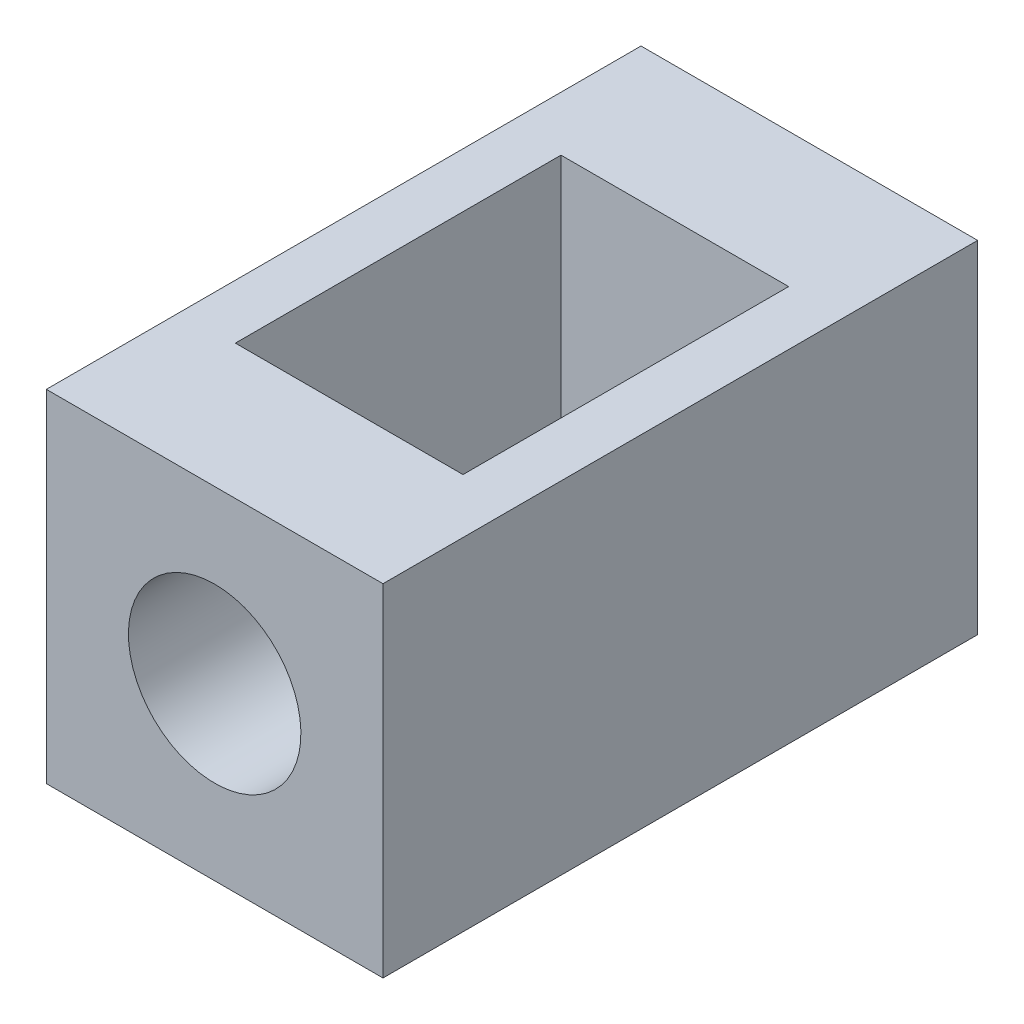
ISO-10303-21;
HEADER;
FILE_DESCRIPTION(('STEP AP214'),'2;1');
FILE_NAME('part.step','',(''),(''),'','','');
FILE_SCHEMA(('AUTOMOTIVE_DESIGN { 1 0 10303 214 1 1 1 1 }'));
ENDSEC;
DATA;
#1=APPLICATION_CONTEXT('core data for automotive mechanical design processes');
#2=APPLICATION_PROTOCOL_DEFINITION('international standard','automotive_design',2000,#1);
#3=PRODUCT_CONTEXT('',#1,'mechanical');
#4=PRODUCT('Part','Part','',(#3));
#5=PRODUCT_RELATED_PRODUCT_CATEGORY('part','',(#4));
#6=PRODUCT_DEFINITION_FORMATION('','',#4);
#7=PRODUCT_DEFINITION_CONTEXT('part definition',#1,'design');
#8=PRODUCT_DEFINITION('design','',#6,#7);
#9=PRODUCT_DEFINITION_SHAPE('','',#8);
#10=(LENGTH_UNIT() NAMED_UNIT(*) SI_UNIT(.MILLI.,.METRE.));
#11=(NAMED_UNIT(*) PLANE_ANGLE_UNIT() SI_UNIT($,.RADIAN.));
#12=(NAMED_UNIT(*) SI_UNIT($,.STERADIAN.) SOLID_ANGLE_UNIT());
#13=UNCERTAINTY_MEASURE_WITH_UNIT(LENGTH_MEASURE(1.E-05),#10,'distance_accuracy_value','');
#14=(GEOMETRIC_REPRESENTATION_CONTEXT(3) GLOBAL_UNCERTAINTY_ASSIGNED_CONTEXT((#13)) GLOBAL_UNIT_ASSIGNED_CONTEXT((#10,
#11,#12)) REPRESENTATION_CONTEXT('',''));
#15=CARTESIAN_POINT('',(0.,0.,0.));
#16=DIRECTION('',(0.,0.,1.));
#17=DIRECTION('',(1.,0.,0.));
#18=AXIS2_PLACEMENT_3D('',#15,#16,#17);
#19=CARTESIAN_POINT('',(-7.60780190320781,-23.3190340135445,14.4950000000002));
#20=DIRECTION('',(0.,0.,1.));
#21=DIRECTION('',(3.01991605000675E-07,0.999999999999954,0.));
#22=AXIS2_PLACEMENT_3D('',#19,#20,#21);
#23=CYLINDRICAL_SURFACE('',#22,1.25);
#24=CARTESIAN_POINT('',(-7.60780190320781,-23.3190340135447,12.5450000000002));
#25=DIRECTION('',(0.,0.,1.));
#26=DIRECTION('',(3.01991605000675E-07,0.999999999999954,0.));
#27=AXIS2_PLACEMENT_3D('',#24,#25,#26);
#28=CIRCLE('',#27,1.25);
#29=CARTESIAN_POINT('',(-7.6078015257183,-22.0690340135448,12.5450000000002));
#30=VERTEX_POINT('',#29);
#31=EDGE_CURVE('E20',#30,#30,#28,.T.);
#32=ORIENTED_EDGE('',*,*,#31,.F.);
#33=EDGE_LOOP('',(#32));
#34=FACE_BOUND('',#33,.T.);
#35=CARTESIAN_POINT('',(-7.60780190320781,-23.3190340135445,14.4950000000002));
#36=DIRECTION('',(0.,0.,1.));
#37=DIRECTION('',(3.01991605000675E-07,0.999999999999954,0.));
#38=AXIS2_PLACEMENT_3D('',#35,#36,#37);
#39=CIRCLE('',#38,1.25);
#40=CARTESIAN_POINT('',(-7.6078015257183,-22.0690340135446,14.4950000000002));
#41=VERTEX_POINT('',#40);
#42=EDGE_CURVE('E11',#41,#41,#39,.T.);
#43=ORIENTED_EDGE('',*,*,#42,.T.);
#44=EDGE_LOOP('',(#43));
#45=FACE_BOUND('',#44,.T.);
#46=ADVANCED_FACE('F17',(#34,#45),#23,.F.);
#47=CARTESIAN_POINT('',(-5.16780265063682,-25.7940347504043,14.4950000000003));
#48=DIRECTION('',(-0.999999999999954,3.01991605000676E-07,0.));
#49=DIRECTION('',(3.01991605000675E-07,0.999999999999954,0.));
#50=AXIS2_PLACEMENT_3D('',#47,#48,#49);
#51=PLANE('',#50);
#52=DIRECTION('',(0.,0.,1.));
#53=VECTOR('',#52,1.);
#54=CARTESIAN_POINT('',(-5.16780115577881,-20.8440347504045,14.4950000000002));
#55=LINE('',#54,#53);
#56=CARTESIAN_POINT('',(-5.16780115577781,-20.8440347504048,5.87500000000026));
#57=VERTEX_POINT('',#56);
#58=CARTESIAN_POINT('',(-5.16780115577881,-20.8440347504045,14.4950000000002));
#59=VERTEX_POINT('',#58);
#60=EDGE_CURVE('E171',#57,#59,#55,.T.);
#61=ORIENTED_EDGE('',*,*,#60,.T.);
#62=DIRECTION('',(3.01991605000675E-07,0.999999999999954,0.));
#63=VECTOR('',#62,1.);
#64=CARTESIAN_POINT('',(-5.16780265063682,-25.7940347504043,14.4950000000003));
#65=LINE('',#64,#63);
#66=CARTESIAN_POINT('',(-5.16780265063682,-25.7940347504043,14.4950000000003));
#67=VERTEX_POINT('',#66);
#68=EDGE_CURVE('E27',#67,#59,#65,.T.);
#69=ORIENTED_EDGE('',*,*,#68,.F.);
#70=DIRECTION('',(0.,0.,1.));
#71=VECTOR('',#70,1.);
#72=CARTESIAN_POINT('',(-5.16780265063682,-25.7940347504043,14.4950000000003));
#73=LINE('',#72,#71);
#74=CARTESIAN_POINT('',(-5.16780265063682,-25.7940347504043,5.87500000000023));
#75=VERTEX_POINT('',#74);
#76=EDGE_CURVE('E224',#75,#67,#73,.T.);
#77=ORIENTED_EDGE('',*,*,#76,.F.);
#78=DIRECTION('',(3.01991605000675E-07,0.999999999999954,0.));
#79=VECTOR('',#78,1.);
#80=CARTESIAN_POINT('',(-5.16780265063682,-25.7940347504043,5.87500000000023));
#81=LINE('',#80,#79);
#82=EDGE_CURVE('E73',#75,#57,#81,.T.);
#83=ORIENTED_EDGE('',*,*,#82,.T.);
#84=EDGE_LOOP('',(#61,#69,#77,#83));
#85=FACE_BOUND('',#84,.T.);
#86=ADVANCED_FACE('F282',(#85),#51,.F.);
#87=CARTESIAN_POINT('',(-10.0478026506368,-25.7940332766853,14.4950000000002));
#88=DIRECTION('',(0.,0.,-1.));
#89=DIRECTION('',(0.999999999999954,-3.01991605000676E-07,0.));
#90=AXIS2_PLACEMENT_3D('',#87,#88,#89);
#91=PLANE('',#90);
#92=ORIENTED_EDGE('',*,*,#42,.F.);
#93=EDGE_LOOP('',(#92));
#94=FACE_BOUND('',#93,.T.);
#95=DIRECTION('',(-0.999999999999954,3.01991605000676E-07,0.));
#96=VECTOR('',#95,1.);
#97=CARTESIAN_POINT('',(-10.0478011557778,-20.8440332766855,14.4950000000001));
#98=LINE('',#97,#96);
#99=CARTESIAN_POINT('',(-10.0478011557778,-20.8440332766855,14.4950000000001));
#100=VERTEX_POINT('',#99);
#101=EDGE_CURVE('E208',#59,#100,#98,.T.);
#102=ORIENTED_EDGE('',*,*,#101,.T.);
#103=DIRECTION('',(3.01991605000675E-07,0.999999999999954,0.));
#104=VECTOR('',#103,1.);
#105=CARTESIAN_POINT('',(-10.0478026506368,-25.7940332766853,14.4950000000002));
#106=LINE('',#105,#104);
#107=CARTESIAN_POINT('',(-10.0478026506368,-25.7940332766853,14.4950000000002));
#108=VERTEX_POINT('',#107);
#109=EDGE_CURVE('E213',#108,#100,#106,.T.);
#110=ORIENTED_EDGE('',*,*,#109,.F.);
#111=DIRECTION('',(-0.999999999999954,3.01991605000676E-07,0.));
#112=VECTOR('',#111,1.);
#113=CARTESIAN_POINT('',(-10.0478026506368,-25.7940332766853,14.4950000000002));
#114=LINE('',#113,#112);
#115=EDGE_CURVE('E219',#67,#108,#114,.T.);
#116=ORIENTED_EDGE('',*,*,#115,.F.);
#117=ORIENTED_EDGE('',*,*,#68,.T.);
#118=EDGE_LOOP('',(#102,#110,#116,#117));
#119=FACE_BOUND('',#118,.T.);
#120=ADVANCED_FACE('F285',(#94,#119),#91,.F.);
#121=CARTESIAN_POINT('',(-10.0478026506368,-25.7940332766853,14.4950000000002));
#122=DIRECTION('',(0.999999999999954,-3.01991605000676E-07,0.));
#123=DIRECTION('',(-3.01991605000675E-07,-0.999999999999954,0.));
#124=AXIS2_PLACEMENT_3D('',#121,#122,#123);
#125=PLANE('',#124);
#126=DIRECTION('',(0.,0.,-1.));
#127=VECTOR('',#126,1.);
#128=CARTESIAN_POINT('',(-10.0478011557778,-20.8440332766855,14.4950000000001));
#129=LINE('',#128,#127);
#130=CARTESIAN_POINT('',(-10.0478011557778,-20.8440332766858,5.8750000000002));
#131=VERTEX_POINT('',#130);
#132=EDGE_CURVE('E196',#100,#131,#129,.T.);
#133=ORIENTED_EDGE('',*,*,#132,.T.);
#134=DIRECTION('',(3.01991605000675E-07,0.999999999999954,0.));
#135=VECTOR('',#134,1.);
#136=CARTESIAN_POINT('',(-10.0478026506368,-25.7940332766852,5.87500000000016));
#137=LINE('',#136,#135);
#138=CARTESIAN_POINT('',(-10.0478026506368,-25.7940332766852,5.87500000000016));
#139=VERTEX_POINT('',#138);
#140=EDGE_CURVE('E39',#139,#131,#137,.T.);
#141=ORIENTED_EDGE('',*,*,#140,.F.);
#142=DIRECTION('',(0.,0.,-1.));
#143=VECTOR('',#142,1.);
#144=CARTESIAN_POINT('',(-10.0478026506368,-25.7940332766853,14.4950000000002));
#145=LINE('',#144,#143);
#146=EDGE_CURVE('E203',#108,#139,#145,.T.);
#147=ORIENTED_EDGE('',*,*,#146,.F.);
#148=ORIENTED_EDGE('',*,*,#109,.T.);
#149=EDGE_LOOP('',(#133,#141,#147,#148));
#150=FACE_BOUND('',#149,.T.);
#151=ADVANCED_FACE('F287',(#150),#125,.F.);
#152=CARTESIAN_POINT('',(-10.0478026506368,-25.7940332766852,5.87500000000016));
#153=DIRECTION('',(0.,0.,1.));
#154=DIRECTION('',(-0.999999999999954,3.01991605000676E-07,0.));
#155=AXIS2_PLACEMENT_3D('',#152,#153,#154);
#156=PLANE('',#155);
#157=DIRECTION('',(0.999999999999954,-3.01991605000676E-07,0.));
#158=VECTOR('',#157,1.);
#159=CARTESIAN_POINT('',(-10.0478011557778,-20.8440332766858,5.8750000000002));
#160=LINE('',#159,#158);
#161=EDGE_CURVE('E193',#131,#57,#160,.T.);
#162=ORIENTED_EDGE('',*,*,#161,.T.);
#163=ORIENTED_EDGE('',*,*,#82,.F.);
#164=DIRECTION('',(0.999999999999954,-3.01991605000676E-07,0.));
#165=VECTOR('',#164,1.);
#166=CARTESIAN_POINT('',(-10.0478026506368,-25.7940332766852,5.87500000000016));
#167=LINE('',#166,#165);
#168=EDGE_CURVE('E199',#139,#75,#167,.T.);
#169=ORIENTED_EDGE('',*,*,#168,.F.);
#170=ORIENTED_EDGE('',*,*,#140,.T.);
#171=EDGE_LOOP('',(#162,#163,#169,#170));
#172=FACE_BOUND('',#171,.T.);
#173=ADVANCED_FACE('F303',(#172),#156,.F.);
#174=CARTESIAN_POINT('',(-7.60780265063682,-25.7940340135447,10.1850000000002));
#175=DIRECTION('',(-3.01991605000675E-07,-0.999999999999954,0.));
#176=DIRECTION('',(-0.999999999999954,3.01991605000676E-07,0.));
#177=AXIS2_PLACEMENT_3D('',#174,#175,#176);
#178=PLANE('',#177);
#179=DIRECTION('',(0.,0.,1.));
#180=VECTOR('',#179,1.);
#181=CARTESIAN_POINT('',(-5.95780265063681,-25.794034511831,10.1850000000002));
#182=LINE('',#181,#180);
#183=CARTESIAN_POINT('',(-5.95780265063681,-25.794034511831,7.82500000000022));
#184=VERTEX_POINT('',#183);
#185=CARTESIAN_POINT('',(-5.95780265063681,-25.7940345118309,12.5450000000002));
#186=VERTEX_POINT('',#185);
#187=EDGE_CURVE('E166',#184,#186,#182,.T.);
#188=ORIENTED_EDGE('',*,*,#187,.F.);
#189=DIRECTION('',(0.999999999999954,-3.01991605000676E-07,0.));
#190=VECTOR('',#189,1.);
#191=CARTESIAN_POINT('',(-7.60780265063682,-25.7940340135447,7.8250000000002));
#192=LINE('',#191,#190);
#193=CARTESIAN_POINT('',(-9.25780265063682,-25.7940335152587,7.82500000000018));
#194=VERTEX_POINT('',#193);
#195=EDGE_CURVE('E127',#194,#184,#192,.T.);
#196=ORIENTED_EDGE('',*,*,#195,.F.);
#197=DIRECTION('',(0.,0.,-1.));
#198=VECTOR('',#197,1.);
#199=CARTESIAN_POINT('',(-9.25780265063682,-25.7940335152587,10.1850000000002));
#200=LINE('',#199,#198);
#201=CARTESIAN_POINT('',(-9.25780265063682,-25.7940335152586,12.5450000000002));
#202=VERTEX_POINT('',#201);
#203=EDGE_CURVE('E151',#202,#194,#200,.T.);
#204=ORIENTED_EDGE('',*,*,#203,.F.);
#205=DIRECTION('',(-0.999999999999954,3.01991605000676E-07,0.));
#206=VECTOR('',#205,1.);
#207=CARTESIAN_POINT('',(-7.60780265063682,-25.7940340135448,12.5450000000002));
#208=LINE('',#207,#206);
#209=EDGE_CURVE('E140',#186,#202,#208,.T.);
#210=ORIENTED_EDGE('',*,*,#209,.F.);
#211=EDGE_LOOP('',(#188,#196,#204,#210));
#212=FACE_BOUND('',#211,.T.);
#213=ORIENTED_EDGE('',*,*,#76,.T.);
#214=ORIENTED_EDGE('',*,*,#115,.T.);
#215=ORIENTED_EDGE('',*,*,#146,.T.);
#216=ORIENTED_EDGE('',*,*,#168,.T.);
#217=EDGE_LOOP('',(#213,#214,#215,#216));
#218=FACE_BOUND('',#217,.T.);
#219=ADVANCED_FACE('F293',(#212,#218),#178,.T.);
#220=CARTESIAN_POINT('',(-7.60780115577781,-20.8440340135447,10.1850000000002));
#221=DIRECTION('',(-3.01991605000675E-07,-0.999999999999954,0.));
#222=DIRECTION('',(-0.999999999999954,3.01991605000676E-07,0.));
#223=AXIS2_PLACEMENT_3D('',#220,#221,#222);
#224=PLANE('',#223);
#225=DIRECTION('',(0.999999999999954,-3.01991605000676E-07,0.));
#226=VECTOR('',#225,1.);
#227=CARTESIAN_POINT('',(-9.25780115577782,-20.8440335152585,7.82500000000021));
#228=LINE('',#227,#226);
#229=CARTESIAN_POINT('',(-9.25780115577782,-20.8440335152585,7.82500000000021));
#230=VERTEX_POINT('',#229);
#231=CARTESIAN_POINT('',(-5.95780115577782,-20.8440345118316,7.82500000000025));
#232=VERTEX_POINT('',#231);
#233=EDGE_CURVE('E161',#230,#232,#228,.T.);
#234=ORIENTED_EDGE('',*,*,#233,.T.);
#235=DIRECTION('',(0.,0.,1.));
#236=VECTOR('',#235,1.);
#237=CARTESIAN_POINT('',(-5.95780115577882,-20.8440345118318,12.5450000000002));
#238=LINE('',#237,#236);
#239=CARTESIAN_POINT('',(-5.95780115577882,-20.8440345118318,12.5450000000002));
#240=VERTEX_POINT('',#239);
#241=EDGE_CURVE('E84',#232,#240,#238,.T.);
#242=ORIENTED_EDGE('',*,*,#241,.T.);
#243=DIRECTION('',(-0.999999999999954,3.01991605000676E-07,0.));
#244=VECTOR('',#243,1.);
#245=CARTESIAN_POINT('',(-9.25780115577782,-20.8440335152587,12.5450000000002));
#246=LINE('',#245,#244);
#247=CARTESIAN_POINT('',(-9.25780115577782,-20.8440335152587,12.5450000000002));
#248=VERTEX_POINT('',#247);
#249=EDGE_CURVE('E130',#240,#248,#246,.T.);
#250=ORIENTED_EDGE('',*,*,#249,.T.);
#251=DIRECTION('',(0.,0.,-1.));
#252=VECTOR('',#251,1.);
#253=CARTESIAN_POINT('',(-9.25780115577782,-20.8440335152587,12.5450000000002));
#254=LINE('',#253,#252);
#255=EDGE_CURVE('E116',#248,#230,#254,.T.);
#256=ORIENTED_EDGE('',*,*,#255,.T.);
#257=EDGE_LOOP('',(#234,#242,#250,#256));
#258=FACE_BOUND('',#257,.T.);
#259=ORIENTED_EDGE('',*,*,#60,.F.);
#260=ORIENTED_EDGE('',*,*,#161,.F.);
#261=ORIENTED_EDGE('',*,*,#132,.F.);
#262=ORIENTED_EDGE('',*,*,#101,.F.);
#263=EDGE_LOOP('',(#259,#260,#261,#262));
#264=FACE_BOUND('',#263,.T.);
#265=ADVANCED_FACE('F131',(#258,#264),#224,.F.);
#266=CARTESIAN_POINT('',(-5.95780115577882,-20.8440345118318,12.5450000000002));
#267=DIRECTION('',(0.999999999999954,-3.01991605000676E-07,0.));
#268=DIRECTION('',(-3.01991605000675E-07,-0.999999999999954,0.));
#269=AXIS2_PLACEMENT_3D('',#266,#267,#268);
#270=PLANE('',#269);
#271=ORIENTED_EDGE('',*,*,#187,.T.);
#272=DIRECTION('',(-3.01991605000675E-07,-0.999999999999954,0.));
#273=VECTOR('',#272,1.);
#274=CARTESIAN_POINT('',(-5.95780115577882,-20.8440345118318,12.5450000000002));
#275=LINE('',#274,#273);
#276=EDGE_CURVE('E136',#240,#186,#275,.T.);
#277=ORIENTED_EDGE('',*,*,#276,.F.);
#278=ORIENTED_EDGE('',*,*,#241,.F.);
#279=DIRECTION('',(-3.01991605000675E-07,-0.999999999999954,0.));
#280=VECTOR('',#279,1.);
#281=CARTESIAN_POINT('',(-5.95780115577782,-20.8440345118316,7.82500000000025));
#282=LINE('',#281,#280);
#283=EDGE_CURVE('E158',#232,#184,#282,.T.);
#284=ORIENTED_EDGE('',*,*,#283,.T.);
#285=EDGE_LOOP('',(#271,#277,#278,#284));
#286=FACE_BOUND('',#285,.T.);
#287=ADVANCED_FACE('F312',(#286),#270,.F.);
#288=CARTESIAN_POINT('',(-9.25780115577782,-20.8440335152585,7.82500000000021));
#289=DIRECTION('',(0.,0.,-1.));
#290=DIRECTION('',(-3.01991605000675E-07,-0.999999999999954,0.));
#291=AXIS2_PLACEMENT_3D('',#288,#289,#290);
#292=PLANE('',#291);
#293=ORIENTED_EDGE('',*,*,#195,.T.);
#294=ORIENTED_EDGE('',*,*,#283,.F.);
#295=ORIENTED_EDGE('',*,*,#233,.F.);
#296=DIRECTION('',(-3.01991605000675E-07,-0.999999999999954,0.));
#297=VECTOR('',#296,1.);
#298=CARTESIAN_POINT('',(-9.25780115577782,-20.8440335152585,7.82500000000021));
#299=LINE('',#298,#297);
#300=EDGE_CURVE('E124',#230,#194,#299,.T.);
#301=ORIENTED_EDGE('',*,*,#300,.T.);
#302=EDGE_LOOP('',(#293,#294,#295,#301));
#303=FACE_BOUND('',#302,.T.);
#304=ADVANCED_FACE('F315',(#303),#292,.F.);
#305=CARTESIAN_POINT('',(-9.25780115577782,-20.8440335152587,12.5450000000002));
#306=DIRECTION('',(-0.999999999999954,3.01991605000676E-07,0.));
#307=DIRECTION('',(3.01991605000675E-07,0.999999999999954,0.));
#308=AXIS2_PLACEMENT_3D('',#305,#306,#307);
#309=PLANE('',#308);
#310=ORIENTED_EDGE('',*,*,#203,.T.);
#311=ORIENTED_EDGE('',*,*,#300,.F.);
#312=ORIENTED_EDGE('',*,*,#255,.F.);
#313=DIRECTION('',(-3.01991605000675E-07,-0.999999999999954,0.));
#314=VECTOR('',#313,1.);
#315=CARTESIAN_POINT('',(-9.25780115577782,-20.8440335152587,12.5450000000002));
#316=LINE('',#315,#314);
#317=EDGE_CURVE('E121',#248,#202,#316,.T.);
#318=ORIENTED_EDGE('',*,*,#317,.T.);
#319=EDGE_LOOP('',(#310,#311,#312,#318));
#320=FACE_BOUND('',#319,.T.);
#321=ADVANCED_FACE('F119',(#320),#309,.F.);
#322=CARTESIAN_POINT('',(-9.25780115577782,-20.8440335152587,12.5450000000002));
#323=DIRECTION('',(0.,0.,1.));
#324=DIRECTION('',(3.01991605000675E-07,0.999999999999954,0.));
#325=AXIS2_PLACEMENT_3D('',#322,#323,#324);
#326=PLANE('',#325);
#327=ORIENTED_EDGE('',*,*,#31,.T.);
#328=EDGE_LOOP('',(#327));
#329=FACE_BOUND('',#328,.T.);
#330=ORIENTED_EDGE('',*,*,#209,.T.);
#331=ORIENTED_EDGE('',*,*,#317,.F.);
#332=ORIENTED_EDGE('',*,*,#249,.F.);
#333=ORIENTED_EDGE('',*,*,#276,.T.);
#334=EDGE_LOOP('',(#330,#331,#332,#333));
#335=FACE_BOUND('',#334,.T.);
#336=ADVANCED_FACE('F138',(#329,#335),#326,.F.);
#337=CLOSED_SHELL('',(#46,#86,#120,#151,#173,#219,#265,#287,#304,#321,#336));
#338=MANIFOLD_SOLID_BREP('B1',#337);
#339=ADVANCED_BREP_SHAPE_REPRESENTATION('',(#18,#338),#14);
#340=SHAPE_DEFINITION_REPRESENTATION(#9,#339);
ENDSEC;
END-ISO-10303-21;
